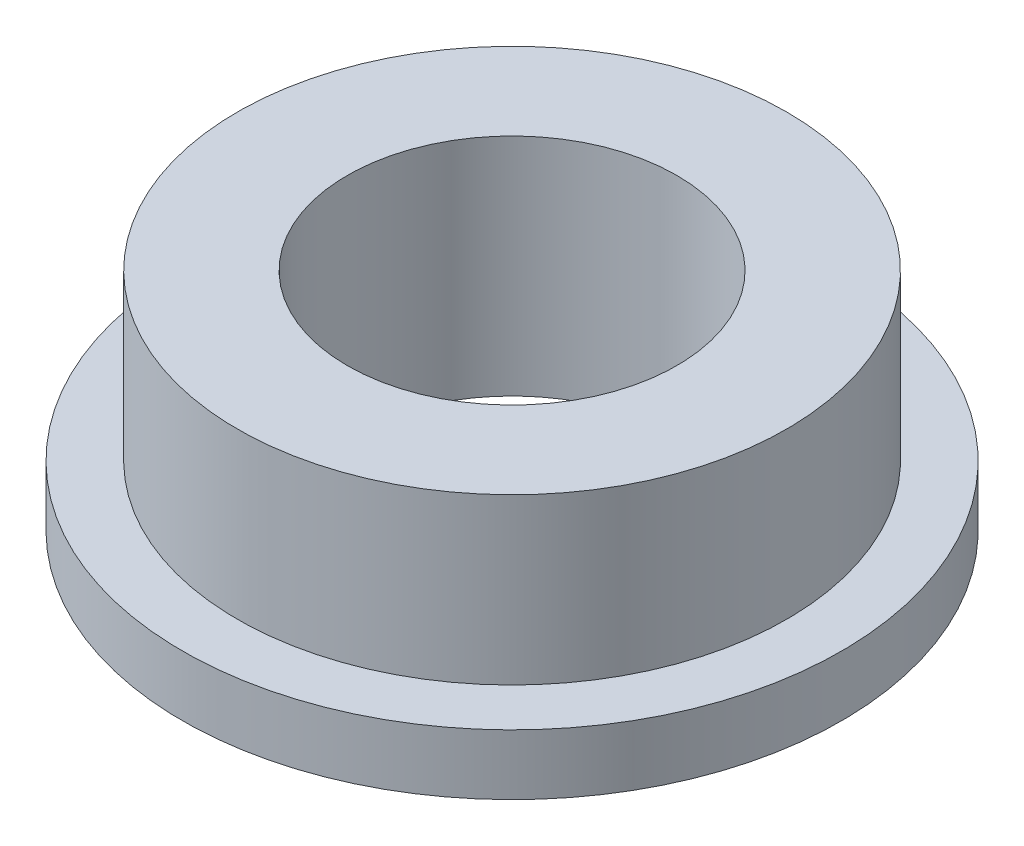
ISO-10303-21;
HEADER;
FILE_DESCRIPTION(('STEP AP214'),'2;1');
FILE_NAME('part.step','',(''),(''),'','','');
FILE_SCHEMA(('AUTOMOTIVE_DESIGN { 1 0 10303 214 1 1 1 1 }'));
ENDSEC;
DATA;
#1=APPLICATION_CONTEXT('core data for automotive mechanical design processes');
#2=APPLICATION_PROTOCOL_DEFINITION('international standard','automotive_design',2000,#1);
#3=PRODUCT_CONTEXT('',#1,'mechanical');
#4=PRODUCT('Part','Part','',(#3));
#5=PRODUCT_RELATED_PRODUCT_CATEGORY('part','',(#4));
#6=PRODUCT_DEFINITION_FORMATION('','',#4);
#7=PRODUCT_DEFINITION_CONTEXT('part definition',#1,'design');
#8=PRODUCT_DEFINITION('design','',#6,#7);
#9=PRODUCT_DEFINITION_SHAPE('','',#8);
#10=(LENGTH_UNIT() NAMED_UNIT(*) SI_UNIT(.MILLI.,.METRE.));
#11=(NAMED_UNIT(*) PLANE_ANGLE_UNIT() SI_UNIT($,.RADIAN.));
#12=(NAMED_UNIT(*) SI_UNIT($,.STERADIAN.) SOLID_ANGLE_UNIT());
#13=UNCERTAINTY_MEASURE_WITH_UNIT(LENGTH_MEASURE(1.E-05),#10,'distance_accuracy_value','');
#14=(GEOMETRIC_REPRESENTATION_CONTEXT(3) GLOBAL_UNCERTAINTY_ASSIGNED_CONTEXT((#13)) GLOBAL_UNIT_ASSIGNED_CONTEXT((#10,
#11,#12)) REPRESENTATION_CONTEXT('',''));
#15=CARTESIAN_POINT('',(0.,0.,0.));
#16=DIRECTION('',(0.,0.,1.));
#17=DIRECTION('',(1.,0.,0.));
#18=AXIS2_PLACEMENT_3D('',#15,#16,#17);
#19=CARTESIAN_POINT('',(0.,0.,0.));
#20=DIRECTION('',(0.,-1.,0.));
#21=DIRECTION('',(0.,0.,-1.));
#22=AXIS2_PLACEMENT_3D('',#19,#20,#21);
#23=CYLINDRICAL_SURFACE('',#22,6.);
#24=CARTESIAN_POINT('',(0.,0.,0.));
#25=DIRECTION('',(0.,-1.,0.));
#26=DIRECTION('',(0.,0.,-1.));
#27=AXIS2_PLACEMENT_3D('',#24,#25,#26);
#28=CIRCLE('',#27,6.);
#29=CARTESIAN_POINT('',(0.,0.,-6.));
#30=VERTEX_POINT('',#29);
#31=EDGE_CURVE('E10',#30,#30,#28,.T.);
#32=ORIENTED_EDGE('',*,*,#31,.F.);
#33=EDGE_LOOP('',(#32));
#34=FACE_BOUND('',#33,.T.);
#35=CARTESIAN_POINT('',(0.,1.1,0.));
#36=DIRECTION('',(0.,-1.,0.));
#37=DIRECTION('',(0.,0.,-1.));
#38=AXIS2_PLACEMENT_3D('',#35,#36,#37);
#39=CIRCLE('',#38,6.);
#40=CARTESIAN_POINT('',(0.,1.1,-6.));
#41=VERTEX_POINT('',#40);
#42=EDGE_CURVE('E68',#41,#41,#39,.T.);
#43=ORIENTED_EDGE('',*,*,#42,.T.);
#44=EDGE_LOOP('',(#43));
#45=FACE_BOUND('',#44,.T.);
#46=ADVANCED_FACE('F41',(#34,#45),#23,.T.);
#47=CARTESIAN_POINT('',(-6.,0.,0.));
#48=DIRECTION('',(0.,1.,0.));
#49=DIRECTION('',(0.,0.,1.));
#50=AXIS2_PLACEMENT_3D('',#47,#48,#49);
#51=PLANE('',#50);
#52=CARTESIAN_POINT('',(0.,0.,0.));
#53=DIRECTION('',(0.,-1.,0.));
#54=DIRECTION('',(0.,0.,-1.));
#55=AXIS2_PLACEMENT_3D('',#52,#53,#54);
#56=CIRCLE('',#55,3.);
#57=CARTESIAN_POINT('',(0.,0.,-3.));
#58=VERTEX_POINT('',#57);
#59=EDGE_CURVE('E48',#58,#58,#56,.T.);
#60=ORIENTED_EDGE('',*,*,#59,.F.);
#61=EDGE_LOOP('',(#60));
#62=FACE_BOUND('',#61,.T.);
#63=ORIENTED_EDGE('',*,*,#31,.T.);
#64=EDGE_LOOP('',(#63));
#65=FACE_BOUND('',#64,.T.);
#66=ADVANCED_FACE('F94',(#62,#65),#51,.F.);
#67=CARTESIAN_POINT('',(0.,0.,0.));
#68=DIRECTION('',(0.,-1.,0.));
#69=DIRECTION('',(0.,0.,-1.));
#70=AXIS2_PLACEMENT_3D('',#67,#68,#69);
#71=CYLINDRICAL_SURFACE('',#70,3.);
#72=CARTESIAN_POINT('',(0.,4.1,0.));
#73=DIRECTION('',(0.,-1.,0.));
#74=DIRECTION('',(0.,0.,-1.));
#75=AXIS2_PLACEMENT_3D('',#72,#73,#74);
#76=CIRCLE('',#75,3.);
#77=CARTESIAN_POINT('',(0.,4.1,-3.));
#78=VERTEX_POINT('',#77);
#79=EDGE_CURVE('E53',#78,#78,#76,.T.);
#80=ORIENTED_EDGE('',*,*,#79,.F.);
#81=EDGE_LOOP('',(#80));
#82=FACE_BOUND('',#81,.T.);
#83=ORIENTED_EDGE('',*,*,#59,.T.);
#84=EDGE_LOOP('',(#83));
#85=FACE_BOUND('',#84,.T.);
#86=ADVANCED_FACE('F89',(#82,#85),#71,.F.);
#87=CARTESIAN_POINT('',(-3.,4.1,0.));
#88=DIRECTION('',(0.,-1.,0.));
#89=DIRECTION('',(0.,0.,-1.));
#90=AXIS2_PLACEMENT_3D('',#87,#88,#89);
#91=PLANE('',#90);
#92=CARTESIAN_POINT('',(0.,4.1,0.));
#93=DIRECTION('',(0.,-1.,0.));
#94=DIRECTION('',(0.,0.,-1.));
#95=AXIS2_PLACEMENT_3D('',#92,#93,#94);
#96=CIRCLE('',#95,5.);
#97=CARTESIAN_POINT('',(0.,4.1,-5.));
#98=VERTEX_POINT('',#97);
#99=EDGE_CURVE('E58',#98,#98,#96,.T.);
#100=ORIENTED_EDGE('',*,*,#99,.F.);
#101=EDGE_LOOP('',(#100));
#102=FACE_BOUND('',#101,.T.);
#103=ORIENTED_EDGE('',*,*,#79,.T.);
#104=EDGE_LOOP('',(#103));
#105=FACE_BOUND('',#104,.T.);
#106=ADVANCED_FACE('F83',(#102,#105),#91,.F.);
#107=CARTESIAN_POINT('',(0.,0.,0.));
#108=DIRECTION('',(0.,-1.,0.));
#109=DIRECTION('',(0.,0.,-1.));
#110=AXIS2_PLACEMENT_3D('',#107,#108,#109);
#111=CYLINDRICAL_SURFACE('',#110,5.);
#112=CARTESIAN_POINT('',(0.,1.1,0.));
#113=DIRECTION('',(0.,-1.,0.));
#114=DIRECTION('',(0.,0.,-1.));
#115=AXIS2_PLACEMENT_3D('',#112,#113,#114);
#116=CIRCLE('',#115,5.);
#117=CARTESIAN_POINT('',(0.,1.1,-5.));
#118=VERTEX_POINT('',#117);
#119=EDGE_CURVE('E64',#118,#118,#116,.T.);
#120=ORIENTED_EDGE('',*,*,#119,.F.);
#121=EDGE_LOOP('',(#120));
#122=FACE_BOUND('',#121,.T.);
#123=ORIENTED_EDGE('',*,*,#99,.T.);
#124=EDGE_LOOP('',(#123));
#125=FACE_BOUND('',#124,.T.);
#126=ADVANCED_FACE('F77',(#122,#125),#111,.T.);
#127=CARTESIAN_POINT('',(-5.,1.1,0.));
#128=DIRECTION('',(0.,-1.,0.));
#129=DIRECTION('',(0.,0.,-1.));
#130=AXIS2_PLACEMENT_3D('',#127,#128,#129);
#131=PLANE('',#130);
#132=ORIENTED_EDGE('',*,*,#42,.F.);
#133=EDGE_LOOP('',(#132));
#134=FACE_BOUND('',#133,.T.);
#135=ORIENTED_EDGE('',*,*,#119,.T.);
#136=EDGE_LOOP('',(#135));
#137=FACE_BOUND('',#136,.T.);
#138=ADVANCED_FACE('F74',(#134,#137),#131,.F.);
#139=CLOSED_SHELL('',(#46,#66,#86,#106,#126,#138));
#140=MANIFOLD_SOLID_BREP('B2',#139);
#141=ADVANCED_BREP_SHAPE_REPRESENTATION('',(#18,#140),#14);
#142=SHAPE_DEFINITION_REPRESENTATION(#9,#141);
ENDSEC;
END-ISO-10303-21;
